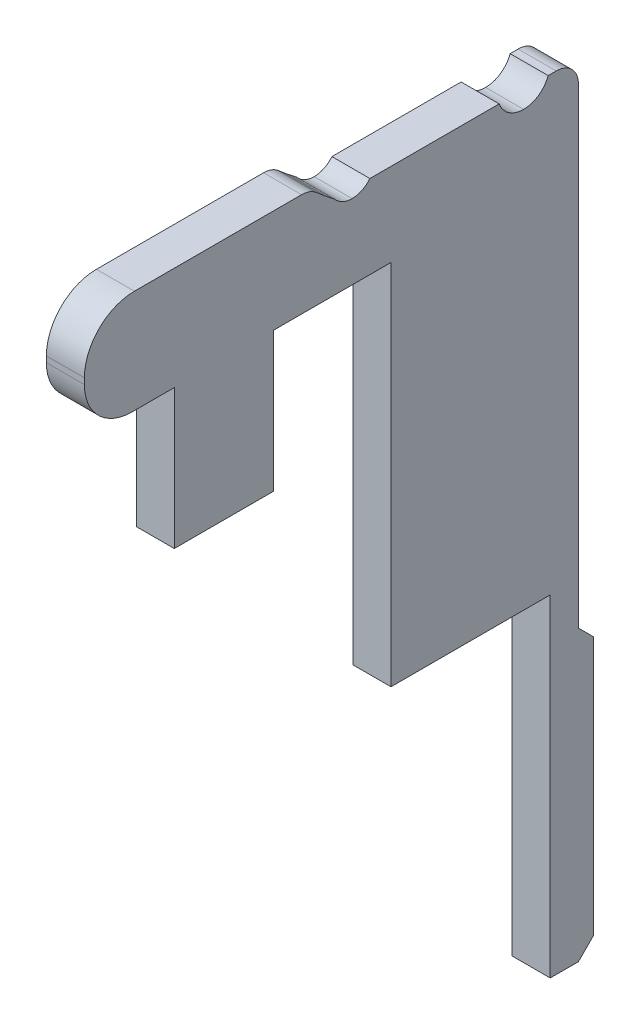
ISO-10303-21;
HEADER;
FILE_DESCRIPTION(('STEP AP214'),'2;1');
FILE_NAME('part.step','',(''),(''),'','','');
FILE_SCHEMA(('AUTOMOTIVE_DESIGN { 1 0 10303 214 1 1 1 1 }'));
ENDSEC;
DATA;
#1=APPLICATION_CONTEXT('core data for automotive mechanical design processes');
#2=APPLICATION_PROTOCOL_DEFINITION('international standard','automotive_design',2000,#1);
#3=PRODUCT_CONTEXT('',#1,'mechanical');
#4=PRODUCT('Part','Part','',(#3));
#5=PRODUCT_RELATED_PRODUCT_CATEGORY('part','',(#4));
#6=PRODUCT_DEFINITION_FORMATION('','',#4);
#7=PRODUCT_DEFINITION_CONTEXT('part definition',#1,'design');
#8=PRODUCT_DEFINITION('design','',#6,#7);
#9=PRODUCT_DEFINITION_SHAPE('','',#8);
#10=(LENGTH_UNIT() NAMED_UNIT(*) SI_UNIT(.MILLI.,.METRE.));
#11=(NAMED_UNIT(*) PLANE_ANGLE_UNIT() SI_UNIT($,.RADIAN.));
#12=(NAMED_UNIT(*) SI_UNIT($,.STERADIAN.) SOLID_ANGLE_UNIT());
#13=UNCERTAINTY_MEASURE_WITH_UNIT(LENGTH_MEASURE(1.E-05),#10,'distance_accuracy_value','');
#14=(GEOMETRIC_REPRESENTATION_CONTEXT(3) GLOBAL_UNCERTAINTY_ASSIGNED_CONTEXT((#13)) GLOBAL_UNIT_ASSIGNED_CONTEXT((#10,
#11,#12)) REPRESENTATION_CONTEXT('',''));
#15=CARTESIAN_POINT('',(0.,0.,0.));
#16=DIRECTION('',(0.,0.,1.));
#17=DIRECTION('',(1.,0.,0.));
#18=AXIS2_PLACEMENT_3D('',#15,#16,#17);
#19=CARTESIAN_POINT('',(9.810320236025,-11.01654617923,3.239858541256));
#20=DIRECTION('',(-1.,0.,0.));
#21=DIRECTION('',(0.,0.,1.));
#22=AXIS2_PLACEMENT_3D('',#19,#20,#21);
#23=PLANE('',#22);
#24=DIRECTION('',(0.,0.,1.));
#25=VECTOR('',#24,1.);
#26=CARTESIAN_POINT('',(9.810320236025,-13.00901257301,1.770030870831));
#27=LINE('',#26,#25);
#28=CARTESIAN_POINT('',(9.810320236025,-13.00901257301,1.770030870831));
#29=VERTEX_POINT('',#28);
#30=CARTESIAN_POINT('',(9.810320236025,-13.00901257301,1.918313485474));
#31=VERTEX_POINT('',#30);
#32=EDGE_CURVE('E11',#29,#31,#27,.T.);
#33=ORIENTED_EDGE('',*,*,#32,.T.);
#34=DIRECTION('',(0.,1.,0.));
#35=VECTOR('',#34,1.);
#36=CARTESIAN_POINT('',(9.810320236025,-13.00901257301,1.918313485474));
#37=LINE('',#36,#35);
#38=CARTESIAN_POINT('',(9.810320236025,-11.26271731696,1.918313485474));
#39=VERTEX_POINT('',#38);
#40=EDGE_CURVE('E25',#31,#39,#37,.T.);
#41=ORIENTED_EDGE('',*,*,#40,.T.);
#42=DIRECTION('',(0.,0.,1.));
#43=VECTOR('',#42,1.);
#44=CARTESIAN_POINT('',(9.810320236025,-11.26271731696,1.918313485474));
#45=LINE('',#44,#43);
#46=CARTESIAN_POINT('',(9.810320236025,-11.26271731696,2.756415222446));
#47=VERTEX_POINT('',#46);
#48=EDGE_CURVE('E442',#39,#47,#45,.T.);
#49=ORIENTED_EDGE('',*,*,#48,.T.);
#50=DIRECTION('',(0.,1.,0.));
#51=VECTOR('',#50,1.);
#52=CARTESIAN_POINT('',(9.810320236025,-11.26271731696,2.756415222446));
#53=LINE('',#52,#51);
#54=CARTESIAN_POINT('',(9.810320236025,-9.32854408862,2.756415222446));
#55=VERTEX_POINT('',#54);
#56=EDGE_CURVE('E438',#47,#55,#53,.T.);
#57=ORIENTED_EDGE('',*,*,#56,.T.);
#58=DIRECTION('',(0.,0.,1.));
#59=VECTOR('',#58,1.);
#60=CARTESIAN_POINT('',(9.810320236025,-9.32854408862,2.756415222446));
#61=LINE('',#60,#59);
#62=CARTESIAN_POINT('',(9.810320236025,-9.32854408862,3.375242668178));
#63=VERTEX_POINT('',#62);
#64=EDGE_CURVE('E434',#55,#63,#61,.T.);
#65=ORIENTED_EDGE('',*,*,#64,.T.);
#66=DIRECTION('',(0.,-1.,0.));
#67=VECTOR('',#66,1.);
#68=CARTESIAN_POINT('',(9.810320236025,-9.32854408862,3.375242668178));
#69=LINE('',#68,#67);
#70=CARTESIAN_POINT('',(9.810320236025,-10.06235805278,3.375242668178));
#71=VERTEX_POINT('',#70);
#72=EDGE_CURVE('E430',#63,#71,#69,.T.);
#73=ORIENTED_EDGE('',*,*,#72,.T.);
#74=DIRECTION('',(0.,0.,1.));
#75=VECTOR('',#74,1.);
#76=CARTESIAN_POINT('',(9.810320236025,-10.06235805278,3.375242668178));
#77=LINE('',#76,#75);
#78=CARTESIAN_POINT('',(9.810320236025,-10.06235805278,3.896881508763));
#79=VERTEX_POINT('',#78);
#80=EDGE_CURVE('E426',#71,#79,#77,.T.);
#81=ORIENTED_EDGE('',*,*,#80,.T.);
#82=DIRECTION('',(0.,1.,0.));
#83=VECTOR('',#82,1.);
#84=CARTESIAN_POINT('',(9.810320236025,-10.06235805278,3.896881508763));
#85=LINE('',#84,#83);
#86=CARTESIAN_POINT('',(9.810320236025,-9.32854408862,3.896881508763));
#87=VERTEX_POINT('',#86);
#88=EDGE_CURVE('E422',#79,#87,#85,.T.);
#89=ORIENTED_EDGE('',*,*,#88,.T.);
#90=DIRECTION('',(0.,0.,1.));
#91=VECTOR('',#90,1.);
#92=CARTESIAN_POINT('',(9.810320236025,-9.32854408862,3.896881508763));
#93=LINE('',#92,#91);
#94=CARTESIAN_POINT('',(9.810320236025,-9.32854408862,4.119955354526));
#95=VERTEX_POINT('',#94);
#96=EDGE_CURVE('E418',#87,#95,#93,.T.);
#97=ORIENTED_EDGE('',*,*,#96,.T.);
#98=CARTESIAN_POINT('',(9.810320236025,-9.078573396371,4.119955354526));
#99=DIRECTION('',(-1.,0.,0.));
#100=DIRECTION('',(0.,-1.,0.));
#101=AXIS2_PLACEMENT_3D('',#98,#99,#100);
#102=CIRCLE('',#101,0.249970692249);
#103=CARTESIAN_POINT('',(9.810320236025,-9.078573396371,4.369926046776));
#104=VERTEX_POINT('',#103);
#105=EDGE_CURVE('E414',#95,#104,#102,.T.);
#106=ORIENTED_EDGE('',*,*,#105,.T.);
#107=DIRECTION('',(0.,1.,0.));
#108=VECTOR('',#107,1.);
#109=CARTESIAN_POINT('',(9.810320236025,-9.078573396371,4.369926046776));
#110=LINE('',#109,#108);
#111=CARTESIAN_POINT('',(9.810320236025,-9.047677018809,4.369926046776));
#112=VERTEX_POINT('',#111);
#113=EDGE_CURVE('E410',#104,#112,#110,.T.);
#114=ORIENTED_EDGE('',*,*,#113,.T.);
#115=CARTESIAN_POINT('',(9.810320236025,-9.047677018809,4.106656913699));
#116=DIRECTION('',(-1.,0.,0.));
#117=DIRECTION('',(0.,0.,1.));
#118=AXIS2_PLACEMENT_3D('',#115,#116,#117);
#119=CIRCLE('',#118,0.263269133077);
#120=CARTESIAN_POINT('',(9.810320236025,-8.784407885732,4.106656913699));
#121=VERTEX_POINT('',#120);
#122=EDGE_CURVE('E406',#112,#121,#119,.T.);
#123=ORIENTED_EDGE('',*,*,#122,.T.);
#124=DIRECTION('',(0.,0.,-1.));
#125=VECTOR('',#124,1.);
#126=CARTESIAN_POINT('',(9.810320236025,-8.784407885732,4.106656913699));
#127=LINE('',#126,#125);
#128=CARTESIAN_POINT('',(9.810320236025,-8.784407885732,3.226860065259));
#129=VERTEX_POINT('',#128);
#130=EDGE_CURVE('E402',#121,#129,#127,.T.);
#131=ORIENTED_EDGE('',*,*,#130,.T.);
#132=CARTESIAN_POINT('',(9.810320236025,-8.903993864904,3.226860065259));
#133=DIRECTION('',(-1.,0.,0.));
#134=DIRECTION('',(0.,1.,0.));
#135=AXIS2_PLACEMENT_3D('',#132,#133,#134);
#136=CIRCLE('',#135,0.119585979172);
#137=CARTESIAN_POINT('',(9.810320236025,-8.812628169562,3.149703625935));
#138=VERTEX_POINT('',#137);
#139=EDGE_CURVE('E398',#129,#138,#136,.T.);
#140=ORIENTED_EDGE('',*,*,#139,.T.);
#141=DIRECTION('',(0.,-0.645196367154793,-0.764016785031755));
#142=VECTOR('',#141,1.);
#143=CARTESIAN_POINT('',(9.810320236025,-8.812628169562,3.149703625935));
#144=LINE('',#143,#142);
#145=CARTESIAN_POINT('',(9.810320236025,-8.855429561475,3.099019859706));
#146=VERTEX_POINT('',#145);
#147=EDGE_CURVE('E394',#138,#146,#144,.T.);
#148=ORIENTED_EDGE('',*,*,#147,.T.);
#149=DIRECTION('',(0.,-0.614333401356799,-0.789046558814742));
#150=VECTOR('',#149,1.);
#151=CARTESIAN_POINT('',(9.810320236025,-8.855429561475,3.099019859706));
#152=LINE('',#151,#150);
#153=CARTESIAN_POINT('',(9.810320236025,-8.890395459246,3.054109846266));
#154=VERTEX_POINT('',#153);
#155=EDGE_CURVE('E390',#146,#154,#152,.T.);
#156=ORIENTED_EDGE('',*,*,#155,.T.);
#157=CARTESIAN_POINT('',(9.810320236025,-8.815690770428,2.960728820981));
#158=DIRECTION('',(1.,0.,0.));
#159=DIRECTION('',(0.,-0.624694377505048,0.78086934548206));
#160=AXIS2_PLACEMENT_3D('',#157,#158,#159);
#161=CIRCLE('',#160,0.119585979172);
#162=CARTESIAN_POINT('',(9.810320236025,-8.9352767496,2.960728820981));
#163=VERTEX_POINT('',#162);
#164=EDGE_CURVE('E386',#154,#163,#161,.T.);
#165=ORIENTED_EDGE('',*,*,#164,.T.);
#166=CARTESIAN_POINT('',(9.810320236025,-8.815690770428,2.960728820981));
#167=DIRECTION('',(1.,0.,0.));
#168=DIRECTION('',(0.,-0.624694377505048,0.78086934548206));
#169=AXIS2_PLACEMENT_3D('',#166,#167,#168);
#170=CIRCLE('',#169,0.119585979172);
#171=CARTESIAN_POINT('',(9.810320236025,-8.890395459246,2.867347795696));
#172=VERTEX_POINT('',#171);
#173=EDGE_CURVE('E382',#163,#172,#170,.T.);
#174=ORIENTED_EDGE('',*,*,#173,.T.);
#175=DIRECTION('',(0.,0.,-1.));
#176=VECTOR('',#175,1.);
#177=CARTESIAN_POINT('',(9.810320236025,-8.890395459246,2.867347795696));
#178=LINE('',#177,#176);
#179=CARTESIAN_POINT('',(9.810320236025,-8.890395459246,2.187227536225));
#180=VERTEX_POINT('',#179);
#181=EDGE_CURVE('E378',#172,#180,#178,.T.);
#182=ORIENTED_EDGE('',*,*,#181,.T.);
#183=CARTESIAN_POINT('',(9.810320236025,-8.842101121503,2.058184733088));
#184=DIRECTION('',(1.,0.,0.));
#185=DIRECTION('',(0.,-0.350507982583099,0.936559744034264));
#186=AXIS2_PLACEMENT_3D('',#183,#184,#185);
#187=CIRCLE('',#186,0.137783845568);
#188=CARTESIAN_POINT('',(9.810320236025,-8.979884967071,2.058184733088));
#189=VERTEX_POINT('',#188);
#190=EDGE_CURVE('E374',#180,#189,#187,.T.);
#191=ORIENTED_EDGE('',*,*,#190,.T.);
#192=CARTESIAN_POINT('',(9.810320236025,-8.842101121503,2.058184733088));
#193=DIRECTION('',(1.,0.,0.));
#194=DIRECTION('',(0.,-0.350507982583099,0.936559744034264));
#195=AXIS2_PLACEMENT_3D('',#192,#193,#194);
#196=CIRCLE('',#195,0.137783845568);
#197=CARTESIAN_POINT('',(9.810320236025,-8.890395459246,1.929141929951));
#198=VERTEX_POINT('',#197);
#199=EDGE_CURVE('E370',#189,#198,#196,.T.);
#200=ORIENTED_EDGE('',*,*,#199,.T.);
#201=DIRECTION('',(0.,0.,-1.));
#202=VECTOR('',#201,1.);
#203=CARTESIAN_POINT('',(9.810320236025,-8.890395459246,1.929141929951));
#204=LINE('',#203,#202);
#205=CARTESIAN_POINT('',(9.810320236025,-8.890395459246,1.887017154804));
#206=VERTEX_POINT('',#205);
#207=EDGE_CURVE('E366',#198,#206,#204,.T.);
#208=ORIENTED_EDGE('',*,*,#207,.T.);
#209=CARTESIAN_POINT('',(9.810320236025,-9.007381743218,1.887017154804));
#210=DIRECTION('',(-1.,0.,0.));
#211=DIRECTION('',(0.,1.,0.));
#212=AXIS2_PLACEMENT_3D('',#209,#210,#211);
#213=CIRCLE('',#212,0.116986283973);
#214=CARTESIAN_POINT('',(9.810320236025,-9.007381743218,1.770030870831));
#215=VERTEX_POINT('',#214);
#216=EDGE_CURVE('E362',#206,#215,#213,.T.);
#217=ORIENTED_EDGE('',*,*,#216,.T.);
#218=DIRECTION('',(0.,-1.,0.));
#219=VECTOR('',#218,1.);
#220=CARTESIAN_POINT('',(9.810320236025,-9.007381743218,1.770030870831));
#221=LINE('',#220,#219);
#222=CARTESIAN_POINT('',(9.810320236025,-11.48809089309,1.770030870831));
#223=VERTEX_POINT('',#222);
#224=EDGE_CURVE('E358',#215,#223,#221,.T.);
#225=ORIENTED_EDGE('',*,*,#224,.T.);
#226=DIRECTION('',(0.,-0.707106781186548,-0.707106781186548));
#227=VECTOR('',#226,1.);
#228=CARTESIAN_POINT('',(9.810320236025,-11.48809089309,1.770030870831));
#229=LINE('',#228,#227);
#230=CARTESIAN_POINT('',(9.810320236025,-11.56808151461,1.690040249312));
#231=VERTEX_POINT('',#230);
#232=EDGE_CURVE('E354',#223,#231,#229,.T.);
#233=ORIENTED_EDGE('',*,*,#232,.T.);
#234=DIRECTION('',(0.,-1.,0.));
#235=VECTOR('',#234,1.);
#236=CARTESIAN_POINT('',(9.810320236025,-11.56808151461,1.690040249312));
#237=LINE('',#236,#235);
#238=CARTESIAN_POINT('',(9.810320236025,-12.92902195149,1.690040249312));
#239=VERTEX_POINT('',#238);
#240=EDGE_CURVE('E350',#231,#239,#237,.T.);
#241=ORIENTED_EDGE('',*,*,#240,.T.);
#242=DIRECTION('',(0.,-0.707106781186548,0.707106781186548));
#243=VECTOR('',#242,1.);
#244=CARTESIAN_POINT('',(9.810320236025,-12.92902195149,1.690040249312));
#245=LINE('',#244,#243);
#246=EDGE_CURVE('E346',#239,#29,#245,.T.);
#247=ORIENTED_EDGE('',*,*,#246,.T.);
#248=EDGE_LOOP('',(#33,#41,#49,#57,#65,#73,#81,#89,#97,#106,#114,#123,#131,#140,#148,#156,#165,
#174,#182,#191,#200,#208,#217,#225,#233,#241,#247));
#249=FACE_BOUND('',#248,.T.);
#250=ADVANCED_FACE('F17',(#249),#23,.T.);
#251=CARTESIAN_POINT('',(9.910308512925,-12.96901726225,1.730035560072));
#252=DIRECTION('',(0.,-0.707106781186548,-0.707106781186548));
#253=DIRECTION('',(0.,-0.707106781186548,0.707106781186548));
#254=AXIS2_PLACEMENT_3D('',#251,#252,#253);
#255=PLANE('',#254);
#256=DIRECTION('',(1.,0.,0.));
#257=VECTOR('',#256,1.);
#258=CARTESIAN_POINT('',(9.810320236025,-13.00901257301,1.770030870831));
#259=LINE('',#258,#257);
#260=CARTESIAN_POINT('',(10.010296789824,-13.00901257301,1.770030870831));
#261=VERTEX_POINT('',#260);
#262=EDGE_CURVE('E211',#29,#261,#259,.T.);
#263=ORIENTED_EDGE('',*,*,#262,.F.);
#264=ORIENTED_EDGE('',*,*,#246,.F.);
#265=DIRECTION('',(1.,0.,0.));
#266=VECTOR('',#265,1.);
#267=CARTESIAN_POINT('',(9.810320236025,-12.92902195149,1.690040249312));
#268=LINE('',#267,#266);
#269=CARTESIAN_POINT('',(10.010296789824,-12.92902195149,1.690040249312));
#270=VERTEX_POINT('',#269);
#271=EDGE_CURVE('E339',#239,#270,#268,.T.);
#272=ORIENTED_EDGE('',*,*,#271,.T.);
#273=DIRECTION('',(0.,0.707106781186548,-0.707106781186548));
#274=VECTOR('',#273,1.);
#275=CARTESIAN_POINT('',(10.010296789824,-13.00901257301,1.770030870831));
#276=LINE('',#275,#274);
#277=EDGE_CURVE('E335',#261,#270,#276,.T.);
#278=ORIENTED_EDGE('',*,*,#277,.F.);
#279=EDGE_LOOP('',(#263,#264,#272,#278));
#280=FACE_BOUND('',#279,.T.);
#281=ADVANCED_FACE('F620',(#280),#255,.T.);
#282=CARTESIAN_POINT('',(10.010296789824,-11.01654617923,3.239858541256));
#283=DIRECTION('',(-1.,0.,0.));
#284=DIRECTION('',(0.,0.,1.));
#285=AXIS2_PLACEMENT_3D('',#282,#283,#284);
#286=PLANE('',#285);
#287=DIRECTION('',(0.,-1.,0.));
#288=VECTOR('',#287,1.);
#289=CARTESIAN_POINT('',(10.010296789824,-11.56808151461,1.690040249312));
#290=LINE('',#289,#288);
#291=CARTESIAN_POINT('',(10.010296789824,-11.56808151461,1.690040249312));
#292=VERTEX_POINT('',#291);
#293=EDGE_CURVE('E330',#292,#270,#290,.T.);
#294=ORIENTED_EDGE('',*,*,#293,.F.);
#295=DIRECTION('',(0.,0.707106781186548,0.707106781186548));
#296=VECTOR('',#295,1.);
#297=CARTESIAN_POINT('',(10.010296789824,-11.56808151461,1.690040249312));
#298=LINE('',#297,#296);
#299=CARTESIAN_POINT('',(10.010296789824,-11.48809089309,1.770030870831));
#300=VERTEX_POINT('',#299);
#301=EDGE_CURVE('E326',#292,#300,#298,.T.);
#302=ORIENTED_EDGE('',*,*,#301,.T.);
#303=DIRECTION('',(0.,-1.,0.));
#304=VECTOR('',#303,1.);
#305=CARTESIAN_POINT('',(10.010296789824,-9.007381743218,1.770030870831));
#306=LINE('',#305,#304);
#307=CARTESIAN_POINT('',(10.010296789824,-9.007381743218,1.770030870831));
#308=VERTEX_POINT('',#307);
#309=EDGE_CURVE('E321',#308,#300,#306,.T.);
#310=ORIENTED_EDGE('',*,*,#309,.F.);
#311=CARTESIAN_POINT('',(10.010296789824,-9.007381743218,1.887017154804));
#312=DIRECTION('',(-1.,0.,0.));
#313=DIRECTION('',(0.,1.,0.));
#314=AXIS2_PLACEMENT_3D('',#311,#312,#313);
#315=CIRCLE('',#314,0.116986283973);
#316=CARTESIAN_POINT('',(10.010296789824,-8.890395459246,1.887017154804));
#317=VERTEX_POINT('',#316);
#318=EDGE_CURVE('E316',#317,#308,#315,.T.);
#319=ORIENTED_EDGE('',*,*,#318,.F.);
#320=DIRECTION('',(0.,0.,-1.));
#321=VECTOR('',#320,1.);
#322=CARTESIAN_POINT('',(10.010296789824,-8.890395459246,1.929141929951));
#323=LINE('',#322,#321);
#324=CARTESIAN_POINT('',(10.010296789824,-8.890395459246,1.929141929951));
#325=VERTEX_POINT('',#324);
#326=EDGE_CURVE('E311',#325,#317,#323,.T.);
#327=ORIENTED_EDGE('',*,*,#326,.F.);
#328=CARTESIAN_POINT('',(10.010296789824,-8.842101121503,2.058184733088));
#329=DIRECTION('',(1.,0.,0.));
#330=DIRECTION('',(0.,-0.350507982583099,0.936559744034264));
#331=AXIS2_PLACEMENT_3D('',#328,#329,#330);
#332=CIRCLE('',#331,0.137783845568);
#333=CARTESIAN_POINT('',(10.010296789824,-8.979884967071,2.058184733088));
#334=VERTEX_POINT('',#333);
#335=EDGE_CURVE('E306',#334,#325,#332,.T.);
#336=ORIENTED_EDGE('',*,*,#335,.F.);
#337=CARTESIAN_POINT('',(10.010296789824,-8.842101121503,2.058184733088));
#338=DIRECTION('',(1.,0.,0.));
#339=DIRECTION('',(0.,-0.350507982583099,0.936559744034264));
#340=AXIS2_PLACEMENT_3D('',#337,#338,#339);
#341=CIRCLE('',#340,0.137783845568);
#342=CARTESIAN_POINT('',(10.010296789824,-8.890395459246,2.187227536225));
#343=VERTEX_POINT('',#342);
#344=EDGE_CURVE('E301',#343,#334,#341,.T.);
#345=ORIENTED_EDGE('',*,*,#344,.F.);
#346=DIRECTION('',(0.,0.,-1.));
#347=VECTOR('',#346,1.);
#348=CARTESIAN_POINT('',(10.010296789824,-8.890395459246,2.867347795696));
#349=LINE('',#348,#347);
#350=CARTESIAN_POINT('',(10.010296789824,-8.890395459246,2.867347795696));
#351=VERTEX_POINT('',#350);
#352=EDGE_CURVE('E296',#351,#343,#349,.T.);
#353=ORIENTED_EDGE('',*,*,#352,.F.);
#354=CARTESIAN_POINT('',(10.010296789824,-8.815690770428,2.960728820981));
#355=DIRECTION('',(1.,0.,0.));
#356=DIRECTION('',(0.,-0.624694377505048,0.78086934548206));
#357=AXIS2_PLACEMENT_3D('',#354,#355,#356);
#358=CIRCLE('',#357,0.119585979172);
#359=CARTESIAN_POINT('',(10.010296789824,-8.9352767496,2.960728820981));
#360=VERTEX_POINT('',#359);
#361=EDGE_CURVE('E291',#360,#351,#358,.T.);
#362=ORIENTED_EDGE('',*,*,#361,.F.);
#363=CARTESIAN_POINT('',(10.010296789824,-8.815690770428,2.960728820981));
#364=DIRECTION('',(1.,0.,0.));
#365=DIRECTION('',(0.,-0.624694377505048,0.78086934548206));
#366=AXIS2_PLACEMENT_3D('',#363,#364,#365);
#367=CIRCLE('',#366,0.119585979172);
#368=CARTESIAN_POINT('',(10.010296789824,-8.890395459246,3.054109846266));
#369=VERTEX_POINT('',#368);
#370=EDGE_CURVE('E286',#369,#360,#367,.T.);
#371=ORIENTED_EDGE('',*,*,#370,.F.);
#372=DIRECTION('',(0.,-0.614333401356799,-0.789046558814742));
#373=VECTOR('',#372,1.);
#374=CARTESIAN_POINT('',(10.010296789824,-8.855429561475,3.099019859706));
#375=LINE('',#374,#373);
#376=CARTESIAN_POINT('',(10.010296789824,-8.855429561475,3.099019859706));
#377=VERTEX_POINT('',#376);
#378=EDGE_CURVE('E281',#377,#369,#375,.T.);
#379=ORIENTED_EDGE('',*,*,#378,.F.);
#380=DIRECTION('',(0.,-0.645196367154793,-0.764016785031755));
#381=VECTOR('',#380,1.);
#382=CARTESIAN_POINT('',(10.010296789824,-8.812628169562,3.149703625935));
#383=LINE('',#382,#381);
#384=CARTESIAN_POINT('',(10.010296789824,-8.812628169562,3.149703625935));
#385=VERTEX_POINT('',#384);
#386=EDGE_CURVE('E276',#385,#377,#383,.T.);
#387=ORIENTED_EDGE('',*,*,#386,.F.);
#388=CARTESIAN_POINT('',(10.010296789824,-8.903993864904,3.226860065259));
#389=DIRECTION('',(-1.,0.,0.));
#390=DIRECTION('',(0.,1.,0.));
#391=AXIS2_PLACEMENT_3D('',#388,#389,#390);
#392=CIRCLE('',#391,0.119585979172);
#393=CARTESIAN_POINT('',(10.010296789824,-8.784407885732,3.226860065259));
#394=VERTEX_POINT('',#393);
#395=EDGE_CURVE('E271',#394,#385,#392,.T.);
#396=ORIENTED_EDGE('',*,*,#395,.F.);
#397=DIRECTION('',(0.,0.,-1.));
#398=VECTOR('',#397,1.);
#399=CARTESIAN_POINT('',(10.010296789824,-8.784407885732,4.106656913699));
#400=LINE('',#399,#398);
#401=CARTESIAN_POINT('',(10.010296789824,-8.784407885732,4.106656913699));
#402=VERTEX_POINT('',#401);
#403=EDGE_CURVE('E266',#402,#394,#400,.T.);
#404=ORIENTED_EDGE('',*,*,#403,.F.);
#405=CARTESIAN_POINT('',(10.010296789824,-9.047677018809,4.106656913699));
#406=DIRECTION('',(-1.,0.,0.));
#407=DIRECTION('',(0.,0.,1.));
#408=AXIS2_PLACEMENT_3D('',#405,#406,#407);
#409=CIRCLE('',#408,0.263269133077);
#410=CARTESIAN_POINT('',(10.010296789824,-9.047677018809,4.369926046776));
#411=VERTEX_POINT('',#410);
#412=EDGE_CURVE('E261',#411,#402,#409,.T.);
#413=ORIENTED_EDGE('',*,*,#412,.F.);
#414=DIRECTION('',(0.,1.,0.));
#415=VECTOR('',#414,1.);
#416=CARTESIAN_POINT('',(10.010296789824,-9.078573396371,4.369926046776));
#417=LINE('',#416,#415);
#418=CARTESIAN_POINT('',(10.010296789824,-9.078573396371,4.369926046776));
#419=VERTEX_POINT('',#418);
#420=EDGE_CURVE('E256',#419,#411,#417,.T.);
#421=ORIENTED_EDGE('',*,*,#420,.F.);
#422=CARTESIAN_POINT('',(10.010296789824,-9.078573396371,4.119955354526));
#423=DIRECTION('',(-1.,0.,0.));
#424=DIRECTION('',(0.,-1.,0.));
#425=AXIS2_PLACEMENT_3D('',#422,#423,#424);
#426=CIRCLE('',#425,0.249970692249);
#427=CARTESIAN_POINT('',(10.010296789824,-9.32854408862,4.119955354526));
#428=VERTEX_POINT('',#427);
#429=EDGE_CURVE('E251',#428,#419,#426,.T.);
#430=ORIENTED_EDGE('',*,*,#429,.F.);
#431=DIRECTION('',(0.,0.,1.));
#432=VECTOR('',#431,1.);
#433=CARTESIAN_POINT('',(10.010296789824,-9.32854408862,3.896881508763));
#434=LINE('',#433,#432);
#435=CARTESIAN_POINT('',(10.010296789824,-9.32854408862,3.896881508763));
#436=VERTEX_POINT('',#435);
#437=EDGE_CURVE('E246',#436,#428,#434,.T.);
#438=ORIENTED_EDGE('',*,*,#437,.F.);
#439=DIRECTION('',(0.,1.,0.));
#440=VECTOR('',#439,1.);
#441=CARTESIAN_POINT('',(10.010296789824,-10.06235805278,3.896881508763));
#442=LINE('',#441,#440);
#443=CARTESIAN_POINT('',(10.010296789824,-10.06235805278,3.896881508763));
#444=VERTEX_POINT('',#443);
#445=EDGE_CURVE('E241',#444,#436,#442,.T.);
#446=ORIENTED_EDGE('',*,*,#445,.F.);
#447=DIRECTION('',(0.,0.,1.));
#448=VECTOR('',#447,1.);
#449=CARTESIAN_POINT('',(10.010296789824,-10.06235805278,3.375242668178));
#450=LINE('',#449,#448);
#451=CARTESIAN_POINT('',(10.010296789824,-10.06235805278,3.375242668178));
#452=VERTEX_POINT('',#451);
#453=EDGE_CURVE('E236',#452,#444,#450,.T.);
#454=ORIENTED_EDGE('',*,*,#453,.F.);
#455=DIRECTION('',(0.,-1.,0.));
#456=VECTOR('',#455,1.);
#457=CARTESIAN_POINT('',(10.010296789824,-9.32854408862,3.375242668178));
#458=LINE('',#457,#456);
#459=CARTESIAN_POINT('',(10.010296789824,-9.32854408862,3.375242668178));
#460=VERTEX_POINT('',#459);
#461=EDGE_CURVE('E231',#460,#452,#458,.T.);
#462=ORIENTED_EDGE('',*,*,#461,.F.);
#463=DIRECTION('',(0.,0.,1.));
#464=VECTOR('',#463,1.);
#465=CARTESIAN_POINT('',(10.010296789824,-9.32854408862,2.756415222446));
#466=LINE('',#465,#464);
#467=CARTESIAN_POINT('',(10.010296789824,-9.32854408862,2.756415222446));
#468=VERTEX_POINT('',#467);
#469=EDGE_CURVE('E226',#468,#460,#466,.T.);
#470=ORIENTED_EDGE('',*,*,#469,.F.);
#471=DIRECTION('',(0.,1.,0.));
#472=VECTOR('',#471,1.);
#473=CARTESIAN_POINT('',(10.010296789824,-11.26271731696,2.756415222446));
#474=LINE('',#473,#472);
#475=CARTESIAN_POINT('',(10.010296789824,-11.26271731696,2.756415222446));
#476=VERTEX_POINT('',#475);
#477=EDGE_CURVE('E221',#476,#468,#474,.T.);
#478=ORIENTED_EDGE('',*,*,#477,.F.);
#479=DIRECTION('',(0.,0.,1.));
#480=VECTOR('',#479,1.);
#481=CARTESIAN_POINT('',(10.010296789824,-11.26271731696,1.918313485474));
#482=LINE('',#481,#480);
#483=CARTESIAN_POINT('',(10.010296789824,-11.26271731696,1.918313485474));
#484=VERTEX_POINT('',#483);
#485=EDGE_CURVE('E200',#484,#476,#482,.T.);
#486=ORIENTED_EDGE('',*,*,#485,.F.);
#487=DIRECTION('',(0.,1.,0.));
#488=VECTOR('',#487,1.);
#489=CARTESIAN_POINT('',(10.010296789824,-13.00901257301,1.918313485474));
#490=LINE('',#489,#488);
#491=CARTESIAN_POINT('',(10.010296789824,-13.00901257301,1.918313485474));
#492=VERTEX_POINT('',#491);
#493=EDGE_CURVE('E192',#492,#484,#490,.T.);
#494=ORIENTED_EDGE('',*,*,#493,.F.);
#495=DIRECTION('',(0.,0.,1.));
#496=VECTOR('',#495,1.);
#497=CARTESIAN_POINT('',(10.010296789824,-13.00901257301,1.770030870831));
#498=LINE('',#497,#496);
#499=EDGE_CURVE('E197',#261,#492,#498,.T.);
#500=ORIENTED_EDGE('',*,*,#499,.F.);
#501=ORIENTED_EDGE('',*,*,#277,.T.);
#502=EDGE_LOOP('',(#294,#302,#310,#319,#327,#336,#345,#353,#362,#371,#379,#387,#396,#404,#413,
#421,#430,#438,#446,#454,#462,#470,#478,#486,#494,#500,#501));
#503=FACE_BOUND('',#502,.T.);
#504=ADVANCED_FACE('F194',(#503),#286,.F.);
#505=CARTESIAN_POINT('',(10.010296789824,-13.00901257301,1.690040249312));
#506=DIRECTION('',(0.,-1.,0.));
#507=DIRECTION('',(0.,0.,-1.));
#508=AXIS2_PLACEMENT_3D('',#505,#506,#507);
#509=PLANE('',#508);
#510=ORIENTED_EDGE('',*,*,#499,.T.);
#511=DIRECTION('',(-1.,0.,0.));
#512=VECTOR('',#511,1.);
#513=CARTESIAN_POINT('',(10.010296789824,-13.00901257301,1.918313485474));
#514=LINE('',#513,#512);
#515=EDGE_CURVE('E204',#492,#31,#514,.T.);
#516=ORIENTED_EDGE('',*,*,#515,.T.);
#517=ORIENTED_EDGE('',*,*,#32,.F.);
#518=ORIENTED_EDGE('',*,*,#262,.T.);
#519=EDGE_LOOP('',(#510,#516,#517,#518));
#520=FACE_BOUND('',#519,.T.);
#521=ADVANCED_FACE('F209',(#520),#509,.T.);
#522=CARTESIAN_POINT('',(10.010296789824,-13.00901257301,1.918313485474));
#523=DIRECTION('',(0.,0.,1.));
#524=DIRECTION('',(1.,0.,0.));
#525=AXIS2_PLACEMENT_3D('',#522,#523,#524);
#526=PLANE('',#525);
#527=DIRECTION('',(-1.,0.,0.));
#528=VECTOR('',#527,1.);
#529=CARTESIAN_POINT('',(10.010296789824,-11.26271731696,1.918313485474));
#530=LINE('',#529,#528);
#531=EDGE_CURVE('E207',#484,#39,#530,.T.);
#532=ORIENTED_EDGE('',*,*,#531,.T.);
#533=ORIENTED_EDGE('',*,*,#40,.F.);
#534=ORIENTED_EDGE('',*,*,#515,.F.);
#535=ORIENTED_EDGE('',*,*,#493,.T.);
#536=EDGE_LOOP('',(#532,#533,#534,#535));
#537=FACE_BOUND('',#536,.T.);
#538=ADVANCED_FACE('F205',(#537),#526,.T.);
#539=CARTESIAN_POINT('',(10.010296789824,-11.26271731696,1.918313485474));
#540=DIRECTION('',(0.,-1.,0.));
#541=DIRECTION('',(0.,0.,-1.));
#542=AXIS2_PLACEMENT_3D('',#539,#540,#541);
#543=PLANE('',#542);
#544=DIRECTION('',(-1.,0.,0.));
#545=VECTOR('',#544,1.);
#546=CARTESIAN_POINT('',(10.010296789824,-11.26271731696,2.756415222446));
#547=LINE('',#546,#545);
#548=EDGE_CURVE('E456',#476,#47,#547,.T.);
#549=ORIENTED_EDGE('',*,*,#548,.T.);
#550=ORIENTED_EDGE('',*,*,#48,.F.);
#551=ORIENTED_EDGE('',*,*,#531,.F.);
#552=ORIENTED_EDGE('',*,*,#485,.T.);
#553=EDGE_LOOP('',(#549,#550,#551,#552));
#554=FACE_BOUND('',#553,.T.);
#555=ADVANCED_FACE('F457',(#554),#543,.T.);
#556=CARTESIAN_POINT('',(10.010296789824,-11.26271731696,2.756415222446));
#557=DIRECTION('',(0.,0.,1.));
#558=DIRECTION('',(1.,0.,0.));
#559=AXIS2_PLACEMENT_3D('',#556,#557,#558);
#560=PLANE('',#559);
#561=DIRECTION('',(-1.,0.,0.));
#562=VECTOR('',#561,1.);
#563=CARTESIAN_POINT('',(10.010296789824,-9.32854408862,2.756415222446));
#564=LINE('',#563,#562);
#565=EDGE_CURVE('E459',#468,#55,#564,.T.);
#566=ORIENTED_EDGE('',*,*,#565,.T.);
#567=ORIENTED_EDGE('',*,*,#56,.F.);
#568=ORIENTED_EDGE('',*,*,#548,.F.);
#569=ORIENTED_EDGE('',*,*,#477,.T.);
#570=EDGE_LOOP('',(#566,#567,#568,#569));
#571=FACE_BOUND('',#570,.T.);
#572=ADVANCED_FACE('F461',(#571),#560,.T.);
#573=CARTESIAN_POINT('',(10.010296789824,-9.32854408862,2.756415222446));
#574=DIRECTION('',(0.,-1.,0.));
#575=DIRECTION('',(0.,0.,-1.));
#576=AXIS2_PLACEMENT_3D('',#573,#574,#575);
#577=PLANE('',#576);
#578=DIRECTION('',(-1.,0.,0.));
#579=VECTOR('',#578,1.);
#580=CARTESIAN_POINT('',(10.010296789824,-9.32854408862,3.375242668178));
#581=LINE('',#580,#579);
#582=EDGE_CURVE('E465',#460,#63,#581,.T.);
#583=ORIENTED_EDGE('',*,*,#582,.T.);
#584=ORIENTED_EDGE('',*,*,#64,.F.);
#585=ORIENTED_EDGE('',*,*,#565,.F.);
#586=ORIENTED_EDGE('',*,*,#469,.T.);
#587=EDGE_LOOP('',(#583,#584,#585,#586));
#588=FACE_BOUND('',#587,.T.);
#589=ADVANCED_FACE('F468',(#588),#577,.T.);
#590=CARTESIAN_POINT('',(10.010296789824,-9.32854408862,3.375242668178));
#591=DIRECTION('',(0.,0.,-1.));
#592=DIRECTION('',(0.,-1.,0.));
#593=AXIS2_PLACEMENT_3D('',#590,#591,#592);
#594=PLANE('',#593);
#595=DIRECTION('',(-1.,0.,0.));
#596=VECTOR('',#595,1.);
#597=CARTESIAN_POINT('',(10.010296789824,-10.06235805278,3.375242668178));
#598=LINE('',#597,#596);
#599=EDGE_CURVE('E476',#452,#71,#598,.T.);
#600=ORIENTED_EDGE('',*,*,#599,.T.);
#601=ORIENTED_EDGE('',*,*,#72,.F.);
#602=ORIENTED_EDGE('',*,*,#582,.F.);
#603=ORIENTED_EDGE('',*,*,#461,.T.);
#604=EDGE_LOOP('',(#600,#601,#602,#603));
#605=FACE_BOUND('',#604,.T.);
#606=ADVANCED_FACE('F477',(#605),#594,.T.);
#607=CARTESIAN_POINT('',(10.010296789824,-10.06235805278,3.375242668178));
#608=DIRECTION('',(0.,-1.,0.));
#609=DIRECTION('',(0.,0.,-1.));
#610=AXIS2_PLACEMENT_3D('',#607,#608,#609);
#611=PLANE('',#610);
#612=DIRECTION('',(-1.,0.,0.));
#613=VECTOR('',#612,1.);
#614=CARTESIAN_POINT('',(10.010296789824,-10.06235805278,3.896881508763));
#615=LINE('',#614,#613);
#616=EDGE_CURVE('E479',#444,#79,#615,.T.);
#617=ORIENTED_EDGE('',*,*,#616,.T.);
#618=ORIENTED_EDGE('',*,*,#80,.F.);
#619=ORIENTED_EDGE('',*,*,#599,.F.);
#620=ORIENTED_EDGE('',*,*,#453,.T.);
#621=EDGE_LOOP('',(#617,#618,#619,#620));
#622=FACE_BOUND('',#621,.T.);
#623=ADVANCED_FACE('F481',(#622),#611,.T.);
#624=CARTESIAN_POINT('',(10.010296789824,-10.06235805278,3.896881508763));
#625=DIRECTION('',(0.,0.,1.));
#626=DIRECTION('',(1.,0.,0.));
#627=AXIS2_PLACEMENT_3D('',#624,#625,#626);
#628=PLANE('',#627);
#629=DIRECTION('',(-1.,0.,0.));
#630=VECTOR('',#629,1.);
#631=CARTESIAN_POINT('',(10.010296789824,-9.32854408862,3.896881508763));
#632=LINE('',#631,#630);
#633=EDGE_CURVE('E485',#436,#87,#632,.T.);
#634=ORIENTED_EDGE('',*,*,#633,.T.);
#635=ORIENTED_EDGE('',*,*,#88,.F.);
#636=ORIENTED_EDGE('',*,*,#616,.F.);
#637=ORIENTED_EDGE('',*,*,#445,.T.);
#638=EDGE_LOOP('',(#634,#635,#636,#637));
#639=FACE_BOUND('',#638,.T.);
#640=ADVANCED_FACE('F488',(#639),#628,.T.);
#641=CARTESIAN_POINT('',(10.010296789824,-9.32854408862,3.896881508763));
#642=DIRECTION('',(0.,-1.,0.));
#643=DIRECTION('',(0.,0.,-1.));
#644=AXIS2_PLACEMENT_3D('',#641,#642,#643);
#645=PLANE('',#644);
#646=DIRECTION('',(-1.,0.,0.));
#647=VECTOR('',#646,1.);
#648=CARTESIAN_POINT('',(10.010296789824,-9.32854408862,4.119955354526));
#649=LINE('',#648,#647);
#650=EDGE_CURVE('E496',#428,#95,#649,.T.);
#651=ORIENTED_EDGE('',*,*,#650,.T.);
#652=ORIENTED_EDGE('',*,*,#96,.F.);
#653=ORIENTED_EDGE('',*,*,#633,.F.);
#654=ORIENTED_EDGE('',*,*,#437,.T.);
#655=EDGE_LOOP('',(#651,#652,#653,#654));
#656=FACE_BOUND('',#655,.T.);
#657=ADVANCED_FACE('F497',(#656),#645,.T.);
#658=CARTESIAN_POINT('',(10.010296789824,-9.078573396371,4.119955354526));
#659=DIRECTION('',(-1.,0.,0.));
#660=DIRECTION('',(0.,0.707106781186547,-0.707106781186548));
#661=AXIS2_PLACEMENT_3D('',#658,#659,#660);
#662=CYLINDRICAL_SURFACE('',#661,0.249970692249);
#663=DIRECTION('',(-1.,0.,0.));
#664=VECTOR('',#663,1.);
#665=CARTESIAN_POINT('',(10.010296789824,-9.078573396371,4.369926046776));
#666=LINE('',#665,#664);
#667=EDGE_CURVE('E499',#419,#104,#666,.T.);
#668=ORIENTED_EDGE('',*,*,#667,.T.);
#669=ORIENTED_EDGE('',*,*,#105,.F.);
#670=ORIENTED_EDGE('',*,*,#650,.F.);
#671=ORIENTED_EDGE('',*,*,#429,.T.);
#672=EDGE_LOOP('',(#668,#669,#670,#671));
#673=FACE_BOUND('',#672,.T.);
#674=ADVANCED_FACE('F502',(#673),#662,.T.);
#675=CARTESIAN_POINT('',(10.010296789824,-9.078573396371,4.369926046776));
#676=DIRECTION('',(0.,0.,1.));
#677=DIRECTION('',(1.,0.,0.));
#678=AXIS2_PLACEMENT_3D('',#675,#676,#677);
#679=PLANE('',#678);
#680=DIRECTION('',(-1.,0.,0.));
#681=VECTOR('',#680,1.);
#682=CARTESIAN_POINT('',(10.010296789824,-9.047677018809,4.369926046776));
#683=LINE('',#682,#681);
#684=EDGE_CURVE('E505',#411,#112,#683,.T.);
#685=ORIENTED_EDGE('',*,*,#684,.T.);
#686=ORIENTED_EDGE('',*,*,#113,.F.);
#687=ORIENTED_EDGE('',*,*,#667,.F.);
#688=ORIENTED_EDGE('',*,*,#420,.T.);
#689=EDGE_LOOP('',(#685,#686,#687,#688));
#690=FACE_BOUND('',#689,.T.);
#691=ADVANCED_FACE('F650',(#690),#679,.T.);
#692=CARTESIAN_POINT('',(10.010296789824,-9.047677018809,4.106656913699));
#693=DIRECTION('',(-1.,0.,0.));
#694=DIRECTION('',(0.,-0.707106781186548,-0.707106781186548));
#695=AXIS2_PLACEMENT_3D('',#692,#693,#694);
#696=CYLINDRICAL_SURFACE('',#695,0.263269133077);
#697=DIRECTION('',(-1.,0.,0.));
#698=VECTOR('',#697,1.);
#699=CARTESIAN_POINT('',(10.010296789824,-8.784407885732,4.106656913699));
#700=LINE('',#699,#698);
#701=EDGE_CURVE('E508',#402,#121,#700,.T.);
#702=ORIENTED_EDGE('',*,*,#701,.T.);
#703=ORIENTED_EDGE('',*,*,#122,.F.);
#704=ORIENTED_EDGE('',*,*,#684,.F.);
#705=ORIENTED_EDGE('',*,*,#412,.T.);
#706=EDGE_LOOP('',(#702,#703,#704,#705));
#707=FACE_BOUND('',#706,.T.);
#708=ADVANCED_FACE('F653',(#707),#696,.T.);
#709=CARTESIAN_POINT('',(10.010296789824,-8.784407885732,4.106656913699));
#710=DIRECTION('',(0.,1.,0.));
#711=DIRECTION('',(1.,0.,0.));
#712=AXIS2_PLACEMENT_3D('',#709,#710,#711);
#713=PLANE('',#712);
#714=DIRECTION('',(-1.,0.,0.));
#715=VECTOR('',#714,1.);
#716=CARTESIAN_POINT('',(10.010296789824,-8.784407885732,3.226860065259));
#717=LINE('',#716,#715);
#718=EDGE_CURVE('E538',#394,#129,#717,.T.);
#719=ORIENTED_EDGE('',*,*,#718,.T.);
#720=ORIENTED_EDGE('',*,*,#130,.F.);
#721=ORIENTED_EDGE('',*,*,#701,.F.);
#722=ORIENTED_EDGE('',*,*,#403,.T.);
#723=EDGE_LOOP('',(#719,#720,#721,#722));
#724=FACE_BOUND('',#723,.T.);
#725=ADVANCED_FACE('F656',(#724),#713,.T.);
#726=CARTESIAN_POINT('',(10.010296789824,-8.903993864904,3.226860065259));
#727=DIRECTION('',(-1.,0.,0.));
#728=DIRECTION('',(0.,-0.939153018691302,0.343499064748386));
#729=AXIS2_PLACEMENT_3D('',#726,#727,#728);
#730=CYLINDRICAL_SURFACE('',#729,0.119585979172);
#731=DIRECTION('',(-1.,0.,0.));
#732=VECTOR('',#731,1.);
#733=CARTESIAN_POINT('',(10.010296789824,-8.812628169562,3.149703625935));
#734=LINE('',#733,#732);
#735=EDGE_CURVE('E543',#385,#138,#734,.T.);
#736=ORIENTED_EDGE('',*,*,#735,.T.);
#737=ORIENTED_EDGE('',*,*,#139,.F.);
#738=ORIENTED_EDGE('',*,*,#718,.F.);
#739=ORIENTED_EDGE('',*,*,#395,.T.);
#740=EDGE_LOOP('',(#736,#737,#738,#739));
#741=FACE_BOUND('',#740,.T.);
#742=ADVANCED_FACE('F660',(#741),#730,.T.);
#743=CARTESIAN_POINT('',(10.010296789824,-8.812628169562,3.149703625935));
#744=DIRECTION('',(0.,0.764016785031755,-0.645196367154793));
#745=DIRECTION('',(-1.,0.,0.));
#746=AXIS2_PLACEMENT_3D('',#743,#744,#745);
#747=PLANE('',#746);
#748=DIRECTION('',(-1.,0.,0.));
#749=VECTOR('',#748,1.);
#750=CARTESIAN_POINT('',(10.010296789824,-8.855429561475,3.099019859706));
#751=LINE('',#750,#749);
#752=EDGE_CURVE('E548',#377,#146,#751,.T.);
#753=ORIENTED_EDGE('',*,*,#752,.T.);
#754=ORIENTED_EDGE('',*,*,#147,.F.);
#755=ORIENTED_EDGE('',*,*,#735,.F.);
#756=ORIENTED_EDGE('',*,*,#386,.T.);
#757=EDGE_LOOP('',(#753,#754,#755,#756));
#758=FACE_BOUND('',#757,.T.);
#759=ADVANCED_FACE('F664',(#758),#747,.T.);
#760=CARTESIAN_POINT('',(10.010296789824,-8.855429561475,3.099019859706));
#761=DIRECTION('',(0.,0.789046558814742,-0.614333401356799));
#762=DIRECTION('',(-1.,0.,0.));
#763=AXIS2_PLACEMENT_3D('',#760,#761,#762);
#764=PLANE('',#763);
#765=DIRECTION('',(-1.,0.,0.));
#766=VECTOR('',#765,1.);
#767=CARTESIAN_POINT('',(10.010296789824,-8.890395459246,3.054109846266));
#768=LINE('',#767,#766);
#769=EDGE_CURVE('E553',#369,#154,#768,.T.);
#770=ORIENTED_EDGE('',*,*,#769,.T.);
#771=ORIENTED_EDGE('',*,*,#155,.F.);
#772=ORIENTED_EDGE('',*,*,#752,.F.);
#773=ORIENTED_EDGE('',*,*,#378,.T.);
#774=EDGE_LOOP('',(#770,#771,#772,#773));
#775=FACE_BOUND('',#774,.T.);
#776=ADVANCED_FACE('F668',(#775),#764,.T.);
#777=CARTESIAN_POINT('',(10.010296789824,-8.815690770428,2.960728820981));
#778=DIRECTION('',(-1.,0.,0.));
#779=DIRECTION('',(0.,0.901303050451135,-0.433189117184952));
#780=AXIS2_PLACEMENT_3D('',#777,#778,#779);
#781=CYLINDRICAL_SURFACE('',#780,0.119585979172);
#782=DIRECTION('',(-1.,0.,0.));
#783=VECTOR('',#782,1.);
#784=CARTESIAN_POINT('',(9.910308512925,-8.9352767496,2.960728820981));
#785=LINE('',#784,#783);
#786=EDGE_CURVE('E558',#360,#163,#785,.T.);
#787=ORIENTED_EDGE('',*,*,#786,.T.);
#788=ORIENTED_EDGE('',*,*,#164,.F.);
#789=ORIENTED_EDGE('',*,*,#769,.F.);
#790=ORIENTED_EDGE('',*,*,#370,.T.);
#791=EDGE_LOOP('',(#787,#788,#789,#790));
#792=FACE_BOUND('',#791,.T.);
#793=ADVANCED_FACE('F672',(#792),#781,.F.);
#794=CARTESIAN_POINT('',(10.010296789824,-8.815690770428,2.960728820981));
#795=DIRECTION('',(-1.,0.,0.));
#796=DIRECTION('',(0.,0.901303050997574,0.433189116048019));
#797=AXIS2_PLACEMENT_3D('',#794,#795,#796);
#798=CYLINDRICAL_SURFACE('',#797,0.119585979172);
#799=ORIENTED_EDGE('',*,*,#786,.F.);
#800=ORIENTED_EDGE('',*,*,#361,.T.);
#801=DIRECTION('',(-1.,0.,0.));
#802=VECTOR('',#801,1.);
#803=CARTESIAN_POINT('',(10.010296789824,-8.890395459246,2.867347795696));
#804=LINE('',#803,#802);
#805=EDGE_CURVE('E563',#351,#172,#804,.T.);
#806=ORIENTED_EDGE('',*,*,#805,.T.);
#807=ORIENTED_EDGE('',*,*,#173,.F.);
#808=EDGE_LOOP('',(#799,#800,#806,#807));
#809=FACE_BOUND('',#808,.T.);
#810=ADVANCED_FACE('F676',(#809),#798,.F.);
#811=CARTESIAN_POINT('',(10.010296789824,-8.890395459246,2.867347795696));
#812=DIRECTION('',(0.,1.,0.));
#813=DIRECTION('',(1.,0.,0.));
#814=AXIS2_PLACEMENT_3D('',#811,#812,#813);
#815=PLANE('',#814);
#816=DIRECTION('',(-1.,0.,0.));
#817=VECTOR('',#816,1.);
#818=CARTESIAN_POINT('',(10.010296789824,-8.890395459246,2.187227536225));
#819=LINE('',#818,#817);
#820=EDGE_CURVE('E568',#343,#180,#819,.T.);
#821=ORIENTED_EDGE('',*,*,#820,.T.);
#822=ORIENTED_EDGE('',*,*,#181,.F.);
#823=ORIENTED_EDGE('',*,*,#805,.F.);
#824=ORIENTED_EDGE('',*,*,#352,.T.);
#825=EDGE_LOOP('',(#821,#822,#823,#824));
#826=FACE_BOUND('',#825,.T.);
#827=ADVANCED_FACE('F680',(#826),#815,.T.);
#828=CARTESIAN_POINT('',(10.010296789824,-8.842101121503,2.058184733088));
#829=DIRECTION('',(-1.,0.,0.));
#830=DIRECTION('',(0.,0.821738400050759,-0.569864897920567));
#831=AXIS2_PLACEMENT_3D('',#828,#829,#830);
#832=CYLINDRICAL_SURFACE('',#831,0.137783845568);
#833=DIRECTION('',(-1.,0.,0.));
#834=VECTOR('',#833,1.);
#835=CARTESIAN_POINT('',(9.910308512925,-8.979884967071,2.058184733088));
#836=LINE('',#835,#834);
#837=EDGE_CURVE('E573',#334,#189,#836,.T.);
#838=ORIENTED_EDGE('',*,*,#837,.T.);
#839=ORIENTED_EDGE('',*,*,#190,.F.);
#840=ORIENTED_EDGE('',*,*,#820,.F.);
#841=ORIENTED_EDGE('',*,*,#344,.T.);
#842=EDGE_LOOP('',(#838,#839,#840,#841));
#843=FACE_BOUND('',#842,.T.);
#844=ADVANCED_FACE('F684',(#843),#832,.F.);
#845=CARTESIAN_POINT('',(10.010296789824,-8.842101121503,2.058184733088));
#846=DIRECTION('',(-1.,0.,0.));
#847=DIRECTION('',(0.,0.821738393124891,0.569864907907586));
#848=AXIS2_PLACEMENT_3D('',#845,#846,#847);
#849=CYLINDRICAL_SURFACE('',#848,0.137783845568);
#850=ORIENTED_EDGE('',*,*,#837,.F.);
#851=ORIENTED_EDGE('',*,*,#335,.T.);
#852=DIRECTION('',(-1.,0.,0.));
#853=VECTOR('',#852,1.);
#854=CARTESIAN_POINT('',(10.010296789824,-8.890395459246,1.929141929951));
#855=LINE('',#854,#853);
#856=EDGE_CURVE('E578',#325,#198,#855,.T.);
#857=ORIENTED_EDGE('',*,*,#856,.T.);
#858=ORIENTED_EDGE('',*,*,#199,.F.);
#859=EDGE_LOOP('',(#850,#851,#857,#858));
#860=FACE_BOUND('',#859,.T.);
#861=ADVANCED_FACE('F688',(#860),#849,.F.);
#862=CARTESIAN_POINT('',(10.010296789824,-8.890395459246,1.929141929951));
#863=DIRECTION('',(0.,1.,0.));
#864=DIRECTION('',(1.,0.,0.));
#865=AXIS2_PLACEMENT_3D('',#862,#863,#864);
#866=PLANE('',#865);
#867=DIRECTION('',(-1.,0.,0.));
#868=VECTOR('',#867,1.);
#869=CARTESIAN_POINT('',(10.010296789824,-8.890395459246,1.887017154804));
#870=LINE('',#869,#868);
#871=EDGE_CURVE('E583',#317,#206,#870,.T.);
#872=ORIENTED_EDGE('',*,*,#871,.T.);
#873=ORIENTED_EDGE('',*,*,#207,.F.);
#874=ORIENTED_EDGE('',*,*,#856,.F.);
#875=ORIENTED_EDGE('',*,*,#326,.T.);
#876=EDGE_LOOP('',(#872,#873,#874,#875));
#877=FACE_BOUND('',#876,.T.);
#878=ADVANCED_FACE('F692',(#877),#866,.T.);
#879=CARTESIAN_POINT('',(10.010296789824,-9.007381743218,1.887017154804));
#880=DIRECTION('',(-1.,0.,0.));
#881=DIRECTION('',(0.,-0.707106781186549,0.707106781186546));
#882=AXIS2_PLACEMENT_3D('',#879,#880,#881);
#883=CYLINDRICAL_SURFACE('',#882,0.116986283973);
#884=DIRECTION('',(-1.,0.,0.));
#885=VECTOR('',#884,1.);
#886=CARTESIAN_POINT('',(10.010296789824,-9.007381743218,1.770030870831));
#887=LINE('',#886,#885);
#888=EDGE_CURVE('E588',#308,#215,#887,.T.);
#889=ORIENTED_EDGE('',*,*,#888,.T.);
#890=ORIENTED_EDGE('',*,*,#216,.F.);
#891=ORIENTED_EDGE('',*,*,#871,.F.);
#892=ORIENTED_EDGE('',*,*,#318,.T.);
#893=EDGE_LOOP('',(#889,#890,#891,#892));
#894=FACE_BOUND('',#893,.T.);
#895=ADVANCED_FACE('F696',(#894),#883,.T.);
#896=CARTESIAN_POINT('',(10.010296789824,-9.007381743218,1.770030870831));
#897=DIRECTION('',(0.,0.,-1.));
#898=DIRECTION('',(0.,-1.,0.));
#899=AXIS2_PLACEMENT_3D('',#896,#897,#898);
#900=PLANE('',#899);
#901=ORIENTED_EDGE('',*,*,#224,.F.);
#902=ORIENTED_EDGE('',*,*,#888,.F.);
#903=ORIENTED_EDGE('',*,*,#309,.T.);
#904=DIRECTION('',(-1.,0.,0.));
#905=VECTOR('',#904,1.);
#906=CARTESIAN_POINT('',(10.010296789824,-11.48809089309,1.770030870831));
#907=LINE('',#906,#905);
#908=EDGE_CURVE('E593',#300,#223,#907,.T.);
#909=ORIENTED_EDGE('',*,*,#908,.T.);
#910=EDGE_LOOP('',(#901,#902,#903,#909));
#911=FACE_BOUND('',#910,.T.);
#912=ADVANCED_FACE('F617',(#911),#900,.T.);
#913=CARTESIAN_POINT('',(9.910308512925,-11.52808620385,1.730035560072));
#914=DIRECTION('',(0.,0.707106781186548,-0.707106781186548));
#915=DIRECTION('',(-1.,0.,0.));
#916=AXIS2_PLACEMENT_3D('',#913,#914,#915);
#917=PLANE('',#916);
#918=ORIENTED_EDGE('',*,*,#232,.F.);
#919=ORIENTED_EDGE('',*,*,#908,.F.);
#920=ORIENTED_EDGE('',*,*,#301,.F.);
#921=DIRECTION('',(-1.,0.,0.));
#922=VECTOR('',#921,1.);
#923=CARTESIAN_POINT('',(10.010296789824,-11.56808151461,1.690040249312));
#924=LINE('',#923,#922);
#925=EDGE_CURVE('E598',#292,#231,#924,.T.);
#926=ORIENTED_EDGE('',*,*,#925,.T.);
#927=EDGE_LOOP('',(#918,#919,#920,#926));
#928=FACE_BOUND('',#927,.T.);
#929=ADVANCED_FACE('F607',(#928),#917,.T.);
#930=CARTESIAN_POINT('',(10.010296789824,-11.56808151461,1.690040249312));
#931=DIRECTION('',(0.,0.,-1.));
#932=DIRECTION('',(0.,-1.,0.));
#933=AXIS2_PLACEMENT_3D('',#930,#931,#932);
#934=PLANE('',#933);
#935=ORIENTED_EDGE('',*,*,#240,.F.);
#936=ORIENTED_EDGE('',*,*,#925,.F.);
#937=ORIENTED_EDGE('',*,*,#293,.T.);
#938=ORIENTED_EDGE('',*,*,#271,.F.);
#939=EDGE_LOOP('',(#935,#936,#937,#938));
#940=FACE_BOUND('',#939,.T.);
#941=ADVANCED_FACE('F611',(#940),#934,.T.);
#942=CLOSED_SHELL('',(#250,#281,#504,#521,#538,#555,#572,#589,#606,#623,#640,#657,#674,#691,
#708,#725,#742,#759,#776,#793,#810,#827,#844,#861,#878,#895,#912,#929,#941));
#943=MANIFOLD_SOLID_BREP('B1',#942);
#944=ADVANCED_BREP_SHAPE_REPRESENTATION('',(#18,#943),#14);
#945=SHAPE_DEFINITION_REPRESENTATION(#9,#944);
ENDSEC;
END-ISO-10303-21;
